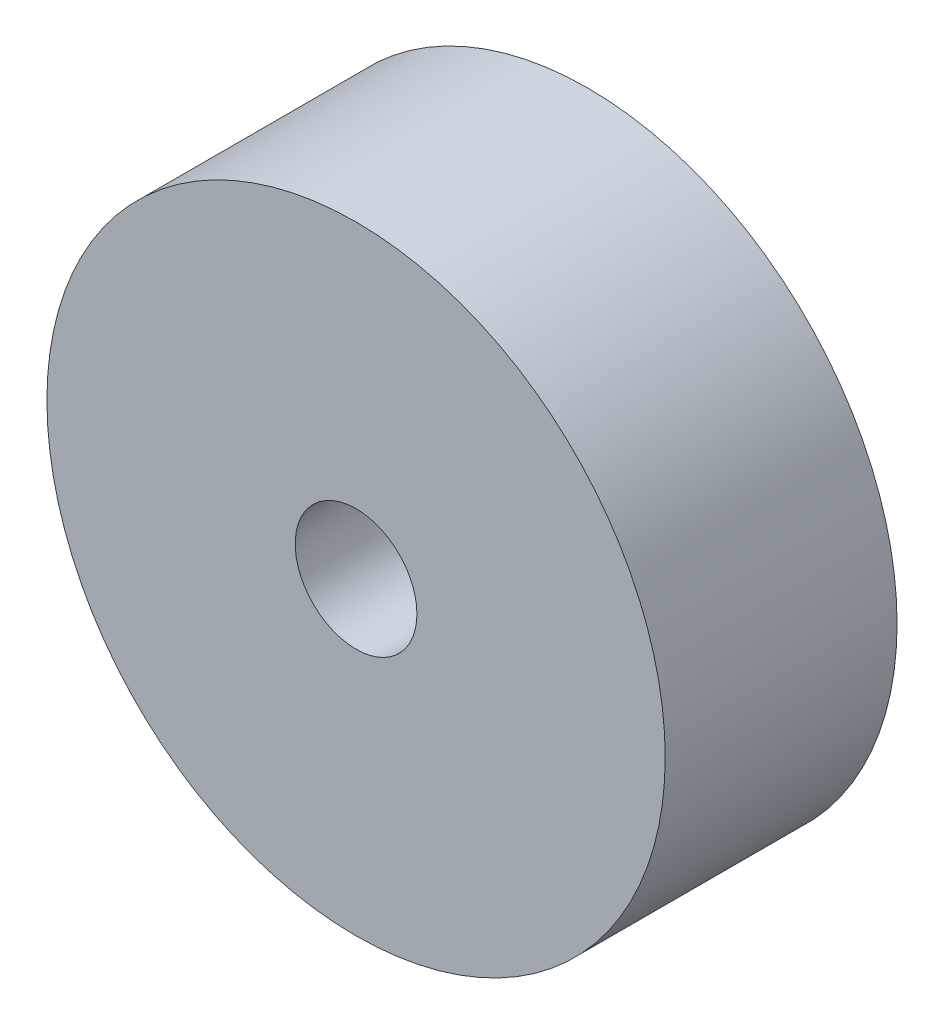
ISO-10303-21;
HEADER;
FILE_DESCRIPTION(('STEP AP214'),'2;1');
FILE_NAME('part.step','',(''),(''),'','','');
FILE_SCHEMA(('AUTOMOTIVE_DESIGN { 1 0 10303 214 1 1 1 1 }'));
ENDSEC;
DATA;
#1=APPLICATION_CONTEXT('core data for automotive mechanical design processes');
#2=APPLICATION_PROTOCOL_DEFINITION('international standard','automotive_design',2000,#1);
#3=PRODUCT_CONTEXT('',#1,'mechanical');
#4=PRODUCT('Part','Part','',(#3));
#5=PRODUCT_RELATED_PRODUCT_CATEGORY('part','',(#4));
#6=PRODUCT_DEFINITION_FORMATION('','',#4);
#7=PRODUCT_DEFINITION_CONTEXT('part definition',#1,'design');
#8=PRODUCT_DEFINITION('design','',#6,#7);
#9=PRODUCT_DEFINITION_SHAPE('','',#8);
#10=(LENGTH_UNIT() NAMED_UNIT(*) SI_UNIT(.MILLI.,.METRE.));
#11=(NAMED_UNIT(*) PLANE_ANGLE_UNIT() SI_UNIT($,.RADIAN.));
#12=(NAMED_UNIT(*) SI_UNIT($,.STERADIAN.) SOLID_ANGLE_UNIT());
#13=UNCERTAINTY_MEASURE_WITH_UNIT(LENGTH_MEASURE(1.E-05),#10,'distance_accuracy_value','');
#14=(GEOMETRIC_REPRESENTATION_CONTEXT(3) GLOBAL_UNCERTAINTY_ASSIGNED_CONTEXT((#13)) GLOBAL_UNIT_ASSIGNED_CONTEXT((#10,
#11,#12)) REPRESENTATION_CONTEXT('',''));
#15=CARTESIAN_POINT('',(0.,0.,0.));
#16=DIRECTION('',(0.,0.,1.));
#17=DIRECTION('',(1.,0.,0.));
#18=AXIS2_PLACEMENT_3D('',#15,#16,#17);
#19=CARTESIAN_POINT('',(0.,0.,9.525));
#20=DIRECTION('',(0.,0.,1.));
#21=DIRECTION('',(1.,0.,0.));
#22=AXIS2_PLACEMENT_3D('',#19,#20,#21);
#23=PLANE('',#22);
#24=CARTESIAN_POINT('',(0.,0.,9.525));
#25=DIRECTION('',(0.,0.,1.));
#26=DIRECTION('',(1.,0.,0.));
#27=AXIS2_PLACEMENT_3D('',#24,#25,#26);
#28=CIRCLE('',#27,25.4);
#29=CARTESIAN_POINT('',(25.4,0.,9.525));
#30=VERTEX_POINT('',#29);
#31=EDGE_CURVE('E10',#30,#30,#28,.T.);
#32=ORIENTED_EDGE('',*,*,#31,.T.);
#33=EDGE_LOOP('',(#32));
#34=FACE_BOUND('',#33,.T.);
#35=CARTESIAN_POINT('',(0.,0.,9.525));
#36=DIRECTION('',(0.,0.,1.));
#37=DIRECTION('',(1.,0.,0.));
#38=AXIS2_PLACEMENT_3D('',#35,#36,#37);
#39=CIRCLE('',#38,5.);
#40=CARTESIAN_POINT('',(5.,0.,9.525));
#41=VERTEX_POINT('',#40);
#42=EDGE_CURVE('E48',#41,#41,#39,.T.);
#43=ORIENTED_EDGE('',*,*,#42,.F.);
#44=EDGE_LOOP('',(#43));
#45=FACE_BOUND('',#44,.T.);
#46=ADVANCED_FACE('F37',(#34,#45),#23,.T.);
#47=CARTESIAN_POINT('',(0.,0.,-9.525));
#48=DIRECTION('',(0.,0.,1.));
#49=DIRECTION('',(1.,0.,0.));
#50=AXIS2_PLACEMENT_3D('',#47,#48,#49);
#51=PLANE('',#50);
#52=CARTESIAN_POINT('',(0.,0.,-9.525));
#53=DIRECTION('',(0.,0.,1.));
#54=DIRECTION('',(1.,0.,0.));
#55=AXIS2_PLACEMENT_3D('',#52,#53,#54);
#56=CIRCLE('',#55,25.4);
#57=CARTESIAN_POINT('',(25.4,0.,-9.525));
#58=VERTEX_POINT('',#57);
#59=EDGE_CURVE('E41',#58,#58,#56,.T.);
#60=ORIENTED_EDGE('',*,*,#59,.F.);
#61=EDGE_LOOP('',(#60));
#62=FACE_BOUND('',#61,.T.);
#63=CARTESIAN_POINT('',(0.,0.,-9.525));
#64=DIRECTION('',(0.,0.,1.));
#65=DIRECTION('',(1.,0.,0.));
#66=AXIS2_PLACEMENT_3D('',#63,#64,#65);
#67=CIRCLE('',#66,5.);
#68=CARTESIAN_POINT('',(5.,0.,-9.525));
#69=VERTEX_POINT('',#68);
#70=EDGE_CURVE('E50',#69,#69,#67,.T.);
#71=ORIENTED_EDGE('',*,*,#70,.T.);
#72=EDGE_LOOP('',(#71));
#73=FACE_BOUND('',#72,.T.);
#74=ADVANCED_FACE('F60',(#62,#73),#51,.F.);
#75=CARTESIAN_POINT('',(0.,0.,9.525));
#76=DIRECTION('',(0.,0.,-1.));
#77=DIRECTION('',(-1.,0.,0.));
#78=AXIS2_PLACEMENT_3D('',#75,#76,#77);
#79=CYLINDRICAL_SURFACE('',#78,25.4);
#80=ORIENTED_EDGE('',*,*,#31,.F.);
#81=EDGE_LOOP('',(#80));
#82=FACE_BOUND('',#81,.T.);
#83=ORIENTED_EDGE('',*,*,#59,.T.);
#84=EDGE_LOOP('',(#83));
#85=FACE_BOUND('',#84,.T.);
#86=ADVANCED_FACE('F39',(#82,#85),#79,.T.);
#87=CARTESIAN_POINT('',(0.,0.,9.525));
#88=DIRECTION('',(0.,0.,-1.));
#89=DIRECTION('',(-1.,0.,0.));
#90=AXIS2_PLACEMENT_3D('',#87,#88,#89);
#91=CYLINDRICAL_SURFACE('',#90,5.);
#92=ORIENTED_EDGE('',*,*,#42,.T.);
#93=EDGE_LOOP('',(#92));
#94=FACE_BOUND('',#93,.T.);
#95=ORIENTED_EDGE('',*,*,#70,.F.);
#96=EDGE_LOOP('',(#95));
#97=FACE_BOUND('',#96,.T.);
#98=ADVANCED_FACE('F56',(#94,#97),#91,.F.);
#99=CLOSED_SHELL('',(#46,#74,#86,#98));
#100=MANIFOLD_SOLID_BREP('B2',#99);
#101=ADVANCED_BREP_SHAPE_REPRESENTATION('',(#18,#100),#14);
#102=SHAPE_DEFINITION_REPRESENTATION(#9,#101);
ENDSEC;
END-ISO-10303-21;
